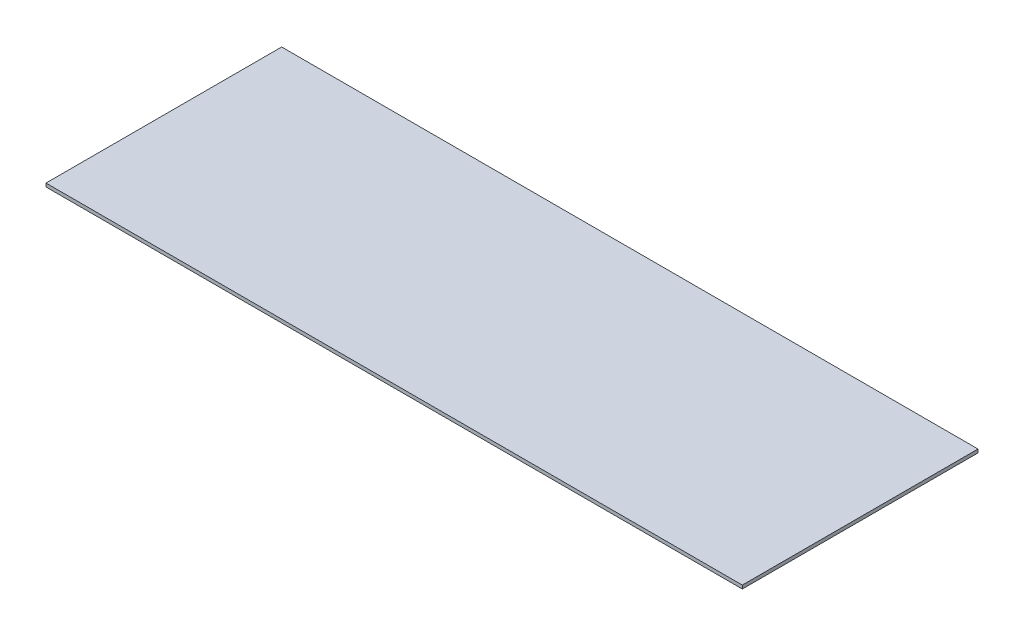
ISO-10303-21;
HEADER;
FILE_DESCRIPTION(('STEP AP214'),'2;1');
FILE_NAME('part.step','',(''),(''),'','','');
FILE_SCHEMA(('AUTOMOTIVE_DESIGN { 1 0 10303 214 1 1 1 1 }'));
ENDSEC;
DATA;
#1=APPLICATION_CONTEXT('core data for automotive mechanical design processes');
#2=APPLICATION_PROTOCOL_DEFINITION('international standard','automotive_design',2000,#1);
#3=PRODUCT_CONTEXT('',#1,'mechanical');
#4=PRODUCT('Part','Part','',(#3));
#5=PRODUCT_RELATED_PRODUCT_CATEGORY('part','',(#4));
#6=PRODUCT_DEFINITION_FORMATION('','',#4);
#7=PRODUCT_DEFINITION_CONTEXT('part definition',#1,'design');
#8=PRODUCT_DEFINITION('design','',#6,#7);
#9=PRODUCT_DEFINITION_SHAPE('','',#8);
#10=(LENGTH_UNIT() NAMED_UNIT(*) SI_UNIT(.MILLI.,.METRE.));
#11=(NAMED_UNIT(*) PLANE_ANGLE_UNIT() SI_UNIT($,.RADIAN.));
#12=(NAMED_UNIT(*) SI_UNIT($,.STERADIAN.) SOLID_ANGLE_UNIT());
#13=UNCERTAINTY_MEASURE_WITH_UNIT(LENGTH_MEASURE(1.E-05),#10,'distance_accuracy_value','');
#14=(GEOMETRIC_REPRESENTATION_CONTEXT(3) GLOBAL_UNCERTAINTY_ASSIGNED_CONTEXT((#13)) GLOBAL_UNIT_ASSIGNED_CONTEXT((#10,
#11,#12)) REPRESENTATION_CONTEXT('',''));
#15=CARTESIAN_POINT('',(0.,0.,0.));
#16=DIRECTION('',(0.,0.,1.));
#17=DIRECTION('',(1.,0.,0.));
#18=AXIS2_PLACEMENT_3D('',#15,#16,#17);
#19=CARTESIAN_POINT('',(-97.1266955266955,1.6,-1.041527392362));
#20=DIRECTION('',(1.,0.,0.));
#21=DIRECTION('',(0.,0.,-1.));
#22=AXIS2_PLACEMENT_3D('',#19,#20,#21);
#23=PLANE('',#22);
#24=DIRECTION('',(0.,0.,1.));
#25=VECTOR('',#24,1.);
#26=CARTESIAN_POINT('',(-97.1266955266955,0.,-1.041527392362));
#27=LINE('',#26,#25);
#28=CARTESIAN_POINT('',(-97.1266955266955,0.,-1.041527392362));
#29=VERTEX_POINT('',#28);
#30=CARTESIAN_POINT('',(-97.1266955266955,0.,108.958472607638));
#31=VERTEX_POINT('',#30);
#32=EDGE_CURVE('E94',#29,#31,#27,.T.);
#33=ORIENTED_EDGE('',*,*,#32,.T.);
#34=DIRECTION('',(0.,-1.,0.));
#35=VECTOR('',#34,1.);
#36=CARTESIAN_POINT('',(-97.1266955266955,1.6,108.958472607638));
#37=LINE('',#36,#35);
#38=CARTESIAN_POINT('',(-97.1266955266955,1.6,108.958472607638));
#39=VERTEX_POINT('',#38);
#40=EDGE_CURVE('E11',#39,#31,#37,.T.);
#41=ORIENTED_EDGE('',*,*,#40,.F.);
#42=DIRECTION('',(0.,0.,1.));
#43=VECTOR('',#42,1.);
#44=CARTESIAN_POINT('',(-97.1266955266955,1.6,-1.041527392362));
#45=LINE('',#44,#43);
#46=CARTESIAN_POINT('',(-97.1266955266955,1.6,-1.041527392362));
#47=VERTEX_POINT('',#46);
#48=EDGE_CURVE('E82',#47,#39,#45,.T.);
#49=ORIENTED_EDGE('',*,*,#48,.F.);
#50=DIRECTION('',(0.,-1.,0.));
#51=VECTOR('',#50,1.);
#52=CARTESIAN_POINT('',(-97.1266955266955,1.6,-1.041527392362));
#53=LINE('',#52,#51);
#54=EDGE_CURVE('E90',#47,#29,#53,.T.);
#55=ORIENTED_EDGE('',*,*,#54,.T.);
#56=EDGE_LOOP('',(#33,#41,#49,#55));
#57=FACE_BOUND('',#56,.T.);
#58=ADVANCED_FACE('F31',(#57),#23,.F.);
#59=CARTESIAN_POINT('',(-97.1266955266955,1.6,108.958472607638));
#60=DIRECTION('',(0.,0.,-1.));
#61=DIRECTION('',(-1.,0.,0.));
#62=AXIS2_PLACEMENT_3D('',#59,#60,#61);
#63=PLANE('',#62);
#64=DIRECTION('',(1.,0.,0.));
#65=VECTOR('',#64,1.);
#66=CARTESIAN_POINT('',(-97.1266955266955,0.,108.958472607638));
#67=LINE('',#66,#65);
#68=CARTESIAN_POINT('',(227.873304473304,0.,108.958472607638));
#69=VERTEX_POINT('',#68);
#70=EDGE_CURVE('E86',#31,#69,#67,.T.);
#71=ORIENTED_EDGE('',*,*,#70,.T.);
#72=DIRECTION('',(0.,-1.,0.));
#73=VECTOR('',#72,1.);
#74=CARTESIAN_POINT('',(227.873304473304,1.6,108.958472607638));
#75=LINE('',#74,#73);
#76=CARTESIAN_POINT('',(227.873304473304,1.6,108.958472607638));
#77=VERTEX_POINT('',#76);
#78=EDGE_CURVE('E39',#77,#69,#75,.T.);
#79=ORIENTED_EDGE('',*,*,#78,.F.);
#80=DIRECTION('',(1.,0.,0.));
#81=VECTOR('',#80,1.);
#82=CARTESIAN_POINT('',(-97.1266955266955,1.6,108.958472607638));
#83=LINE('',#82,#81);
#84=EDGE_CURVE('E77',#39,#77,#83,.T.);
#85=ORIENTED_EDGE('',*,*,#84,.F.);
#86=ORIENTED_EDGE('',*,*,#40,.T.);
#87=EDGE_LOOP('',(#71,#79,#85,#86));
#88=FACE_BOUND('',#87,.T.);
#89=ADVANCED_FACE('F85',(#88),#63,.F.);
#90=CARTESIAN_POINT('',(227.873304473304,1.6,-1.041527392362));
#91=DIRECTION('',(-1.,0.,0.));
#92=DIRECTION('',(0.,0.,1.));
#93=AXIS2_PLACEMENT_3D('',#90,#91,#92);
#94=PLANE('',#93);
#95=DIRECTION('',(0.,0.,-1.));
#96=VECTOR('',#95,1.);
#97=CARTESIAN_POINT('',(227.873304473304,0.,-1.041527392362));
#98=LINE('',#97,#96);
#99=CARTESIAN_POINT('',(227.873304473304,0.,-1.041527392362));
#100=VERTEX_POINT('',#99);
#101=EDGE_CURVE('E64',#69,#100,#98,.T.);
#102=ORIENTED_EDGE('',*,*,#101,.T.);
#103=DIRECTION('',(0.,-1.,0.));
#104=VECTOR('',#103,1.);
#105=CARTESIAN_POINT('',(227.873304473304,1.6,-1.041527392362));
#106=LINE('',#105,#104);
#107=CARTESIAN_POINT('',(227.873304473304,1.6,-1.041527392362));
#108=VERTEX_POINT('',#107);
#109=EDGE_CURVE('E87',#108,#100,#106,.T.);
#110=ORIENTED_EDGE('',*,*,#109,.F.);
#111=DIRECTION('',(0.,0.,-1.));
#112=VECTOR('',#111,1.);
#113=CARTESIAN_POINT('',(227.873304473304,1.6,-1.041527392362));
#114=LINE('',#113,#112);
#115=EDGE_CURVE('E80',#77,#108,#114,.T.);
#116=ORIENTED_EDGE('',*,*,#115,.F.);
#117=ORIENTED_EDGE('',*,*,#78,.T.);
#118=EDGE_LOOP('',(#102,#110,#116,#117));
#119=FACE_BOUND('',#118,.T.);
#120=ADVANCED_FACE('F88',(#119),#94,.F.);
#121=CARTESIAN_POINT('',(-97.1266955266955,1.6,-1.041527392362));
#122=DIRECTION('',(0.,0.,1.));
#123=DIRECTION('',(1.,0.,0.));
#124=AXIS2_PLACEMENT_3D('',#121,#122,#123);
#125=PLANE('',#124);
#126=DIRECTION('',(-1.,0.,0.));
#127=VECTOR('',#126,1.);
#128=CARTESIAN_POINT('',(-97.1266955266955,0.,-1.041527392362));
#129=LINE('',#128,#127);
#130=EDGE_CURVE('E70',#100,#29,#129,.T.);
#131=ORIENTED_EDGE('',*,*,#130,.T.);
#132=ORIENTED_EDGE('',*,*,#54,.F.);
#133=DIRECTION('',(-1.,0.,0.));
#134=VECTOR('',#133,1.);
#135=CARTESIAN_POINT('',(-97.1266955266955,1.6,-1.041527392362));
#136=LINE('',#135,#134);
#137=EDGE_CURVE('E47',#108,#47,#136,.T.);
#138=ORIENTED_EDGE('',*,*,#137,.F.);
#139=ORIENTED_EDGE('',*,*,#109,.T.);
#140=EDGE_LOOP('',(#131,#132,#138,#139));
#141=FACE_BOUND('',#140,.T.);
#142=ADVANCED_FACE('F101',(#141),#125,.F.);
#143=CARTESIAN_POINT('',(-97.1266955266955,1.6,108.958472607638));
#144=DIRECTION('',(0.,1.,0.));
#145=DIRECTION('',(0.,0.,1.));
#146=AXIS2_PLACEMENT_3D('',#143,#144,#145);
#147=PLANE('',#146);
#148=ORIENTED_EDGE('',*,*,#48,.T.);
#149=ORIENTED_EDGE('',*,*,#84,.T.);
#150=ORIENTED_EDGE('',*,*,#115,.T.);
#151=ORIENTED_EDGE('',*,*,#137,.T.);
#152=EDGE_LOOP('',(#148,#149,#150,#151));
#153=FACE_BOUND('',#152,.T.);
#154=ADVANCED_FACE('F78',(#153),#147,.T.);
#155=CARTESIAN_POINT('',(-97.1266955266955,0.,108.958472607638));
#156=DIRECTION('',(0.,1.,0.));
#157=DIRECTION('',(0.,0.,1.));
#158=AXIS2_PLACEMENT_3D('',#155,#156,#157);
#159=PLANE('',#158);
#160=ORIENTED_EDGE('',*,*,#32,.F.);
#161=ORIENTED_EDGE('',*,*,#130,.F.);
#162=ORIENTED_EDGE('',*,*,#101,.F.);
#163=ORIENTED_EDGE('',*,*,#70,.F.);
#164=EDGE_LOOP('',(#160,#161,#162,#163));
#165=FACE_BOUND('',#164,.T.);
#166=ADVANCED_FACE('F104',(#165),#159,.F.);
#167=CLOSED_SHELL('',(#58,#89,#120,#142,#154,#166));
#168=MANIFOLD_SOLID_BREP('B2',#167);
#169=ADVANCED_BREP_SHAPE_REPRESENTATION('',(#18,#168),#14);
#170=SHAPE_DEFINITION_REPRESENTATION(#9,#169);
ENDSEC;
END-ISO-10303-21;
